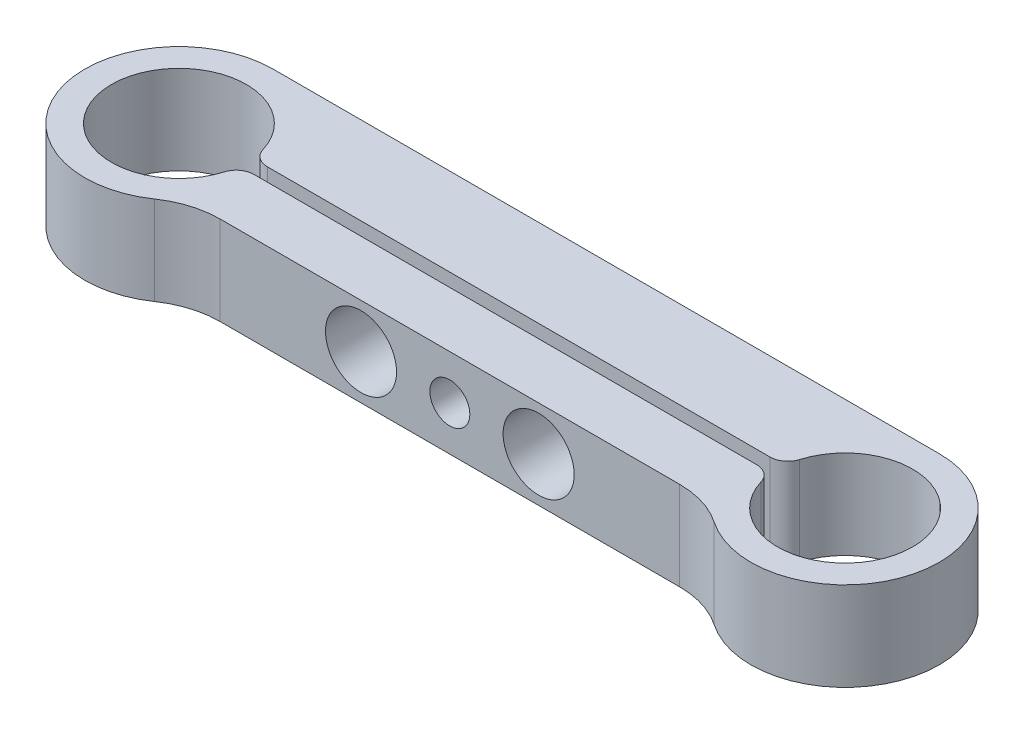
ISO-10303-21;
HEADER;
FILE_DESCRIPTION(('STEP AP214'),'2;1');
FILE_NAME('part.step','',(''),(''),'','','');
FILE_SCHEMA(('AUTOMOTIVE_DESIGN { 1 0 10303 214 1 1 1 1 }'));
ENDSEC;
DATA;
#1=APPLICATION_CONTEXT('core data for automotive mechanical design processes');
#2=APPLICATION_PROTOCOL_DEFINITION('international standard','automotive_design',2000,#1);
#3=PRODUCT_CONTEXT('',#1,'mechanical');
#4=PRODUCT('Part','Part','',(#3));
#5=PRODUCT_RELATED_PRODUCT_CATEGORY('part','',(#4));
#6=PRODUCT_DEFINITION_FORMATION('','',#4);
#7=PRODUCT_DEFINITION_CONTEXT('part definition',#1,'design');
#8=PRODUCT_DEFINITION('design','',#6,#7);
#9=PRODUCT_DEFINITION_SHAPE('','',#8);
#10=(LENGTH_UNIT() NAMED_UNIT(*) SI_UNIT(.MILLI.,.METRE.));
#11=(NAMED_UNIT(*) PLANE_ANGLE_UNIT() SI_UNIT($,.RADIAN.));
#12=(NAMED_UNIT(*) SI_UNIT($,.STERADIAN.) SOLID_ANGLE_UNIT());
#13=UNCERTAINTY_MEASURE_WITH_UNIT(LENGTH_MEASURE(1.E-05),#10,'distance_accuracy_value','');
#14=(GEOMETRIC_REPRESENTATION_CONTEXT(3) GLOBAL_UNCERTAINTY_ASSIGNED_CONTEXT((#13)) GLOBAL_UNIT_ASSIGNED_CONTEXT((#10,
#11,#12)) REPRESENTATION_CONTEXT('',''));
#15=CARTESIAN_POINT('',(0.,0.,0.));
#16=DIRECTION('',(0.,0.,1.));
#17=DIRECTION('',(1.,0.,0.));
#18=AXIS2_PLACEMENT_3D('',#15,#16,#17);
#19=CARTESIAN_POINT('',(75.,10.,-1.34818998548608E-11));
#20=DIRECTION('',(0.,1.,0.));
#21=DIRECTION('',(0.,0.,1.));
#22=AXIS2_PLACEMENT_3D('',#19,#20,#21);
#23=PLANE('',#22);
#24=DIRECTION('',(1.,0.,0.));
#25=VECTOR('',#24,1.);
#26=CARTESIAN_POINT('',(67.0401005031589,10.,7.));
#27=LINE('',#26,#25);
#28=CARTESIAN_POINT('',(11.634431657835,10.,7.00000000000001));
#29=VERTEX_POINT('',#28);
#30=CARTESIAN_POINT('',(63.3655683421966,10.,7.));
#31=VERTEX_POINT('',#30);
#32=EDGE_CURVE('E180',#29,#31,#27,.T.);
#33=ORIENTED_EDGE('',*,*,#32,.T.);
#34=CARTESIAN_POINT('',(63.3655683421966,10.,17.));
#35=DIRECTION('',(0.,1.,0.));
#36=DIRECTION('',(0.,0.,1.));
#37=AXIS2_PLACEMENT_3D('',#34,#35,#36);
#38=CIRCLE('',#37,10.);
#39=CARTESIAN_POINT('',(69.0133507003499,10.,8.74757281553284));
#40=VERTEX_POINT('',#39);
#41=EDGE_CURVE('E156',#31,#40,#38,.F.);
#42=ORIENTED_EDGE('',*,*,#41,.T.);
#43=CARTESIAN_POINT('',(75.,10.,-1.34818998548608E-11));
#44=DIRECTION('',(0.,1.,0.));
#45=DIRECTION('',(0.,0.,1.));
#46=AXIS2_PLACEMENT_3D('',#43,#44,#45);
#47=CIRCLE('',#46,10.6000000000135);
#48=CARTESIAN_POINT('',(75.,10.,-10.6000000000404));
#49=VERTEX_POINT('',#48);
#50=EDGE_CURVE('E149',#40,#49,#47,.T.);
#51=ORIENTED_EDGE('',*,*,#50,.T.);
#52=DIRECTION('',(-1.,0.,0.));
#53=VECTOR('',#52,1.);
#54=CARTESIAN_POINT('',(0.,10.,-10.6000000000404));
#55=LINE('',#54,#53);
#56=CARTESIAN_POINT('',(0.,10.,-10.6000000000202));
#57=VERTEX_POINT('',#56);
#58=EDGE_CURVE('E153',#49,#57,#55,.T.);
#59=ORIENTED_EDGE('',*,*,#58,.T.);
#60=CARTESIAN_POINT('',(0.,10.,0.));
#61=DIRECTION('',(0.,1.,0.));
#62=DIRECTION('',(0.,0.,1.));
#63=AXIS2_PLACEMENT_3D('',#60,#61,#62);
#64=CIRCLE('',#63,10.6000000000202);
#65=CARTESIAN_POINT('',(5.9866492996682,10.,8.74757281554209));
#66=VERTEX_POINT('',#65);
#67=EDGE_CURVE('E170',#57,#66,#64,.T.);
#68=ORIENTED_EDGE('',*,*,#67,.T.);
#69=CARTESIAN_POINT('',(11.634431657835,10.,17.));
#70=DIRECTION('',(0.,1.,0.));
#71=DIRECTION('',(0.,0.,1.));
#72=AXIS2_PLACEMENT_3D('',#69,#70,#71);
#73=CIRCLE('',#72,10.);
#74=EDGE_CURVE('E192',#66,#29,#73,.F.);
#75=ORIENTED_EDGE('',*,*,#74,.T.);
#76=EDGE_LOOP('',(#33,#42,#51,#59,#68,#75));
#77=FACE_BOUND('',#76,.T.);
#78=DIRECTION('',(-1.,0.,0.));
#79=VECTOR('',#78,1.);
#80=CARTESIAN_POINT('',(7.5629028818305,10.,-0.75));
#81=LINE('',#80,#79);
#82=CARTESIAN_POINT('',(65.8023100726297,10.,-0.75));
#83=VERTEX_POINT('',#82);
#84=CARTESIAN_POINT('',(9.19768992736763,10.,-0.75));
#85=VERTEX_POINT('',#84);
#86=EDGE_CURVE('E258',#83,#85,#81,.T.);
#87=ORIENTED_EDGE('',*,*,#86,.F.);
#88=CARTESIAN_POINT('',(65.8023100726297,10.,-2.75));
#89=DIRECTION('',(0.,1.,0.));
#90=DIRECTION('',(0.,0.,1.));
#91=AXIS2_PLACEMENT_3D('',#88,#89,#90);
#92=CIRCLE('',#91,2.);
#93=CARTESIAN_POINT('',(67.7184954741655,10.,-2.17708333333606));
#94=VERTEX_POINT('',#93);
#95=EDGE_CURVE('E220',#83,#94,#92,.T.);
#96=ORIENTED_EDGE('',*,*,#95,.T.);
#97=CARTESIAN_POINT('',(75.,10.,-1.34818998548608E-11));
#98=DIRECTION('',(0.,1.,0.));
#99=DIRECTION('',(0.,0.,1.));
#100=AXIS2_PLACEMENT_3D('',#97,#98,#99);
#101=CIRCLE('',#100,7.59999999999867);
#102=CARTESIAN_POINT('',(67.7184954741718,10.,2.17708333333045));
#103=VERTEX_POINT('',#102);
#104=EDGE_CURVE('E458',#103,#94,#101,.T.);
#105=ORIENTED_EDGE('',*,*,#104,.F.);
#106=CARTESIAN_POINT('',(65.8023100726378,10.,2.75));
#107=DIRECTION('',(0.,1.,0.));
#108=DIRECTION('',(0.,0.,1.));
#109=AXIS2_PLACEMENT_3D('',#106,#107,#108);
#110=CIRCLE('',#109,2.);
#111=CARTESIAN_POINT('',(65.8023100726378,10.,0.75));
#112=VERTEX_POINT('',#111);
#113=EDGE_CURVE('E218',#103,#112,#110,.T.);
#114=ORIENTED_EDGE('',*,*,#113,.T.);
#115=DIRECTION('',(1.,0.,0.));
#116=VECTOR('',#115,1.);
#117=CARTESIAN_POINT('',(7.5629028818305,10.,0.75));
#118=LINE('',#117,#116);
#119=CARTESIAN_POINT('',(9.19768992736763,10.,0.75));
#120=VERTEX_POINT('',#119);
#121=EDGE_CURVE('E234',#120,#112,#118,.T.);
#122=ORIENTED_EDGE('',*,*,#121,.F.);
#123=CARTESIAN_POINT('',(9.19768992736763,10.,2.75));
#124=DIRECTION('',(0.,1.,0.));
#125=DIRECTION('',(0.,0.,1.));
#126=AXIS2_PLACEMENT_3D('',#123,#124,#125);
#127=CIRCLE('',#126,2.);
#128=CARTESIAN_POINT('',(7.28150452583271,10.,2.17708333333333));
#129=VERTEX_POINT('',#128);
#130=EDGE_CURVE('E63',#120,#129,#127,.T.);
#131=ORIENTED_EDGE('',*,*,#130,.T.);
#132=CARTESIAN_POINT('',(0.,10.,0.));
#133=DIRECTION('',(0.,1.,0.));
#134=DIRECTION('',(0.,0.,1.));
#135=AXIS2_PLACEMENT_3D('',#132,#133,#134);
#136=CIRCLE('',#135,7.6);
#137=CARTESIAN_POINT('',(7.28150452583271,10.,-2.17708333333333));
#138=VERTEX_POINT('',#137);
#139=EDGE_CURVE('E252',#138,#129,#136,.T.);
#140=ORIENTED_EDGE('',*,*,#139,.F.);
#141=CARTESIAN_POINT('',(9.19768992736763,10.,-2.75));
#142=DIRECTION('',(0.,1.,0.));
#143=DIRECTION('',(0.,0.,1.));
#144=AXIS2_PLACEMENT_3D('',#141,#142,#143);
#145=CIRCLE('',#144,2.);
#146=EDGE_CURVE('E215',#138,#85,#145,.T.);
#147=ORIENTED_EDGE('',*,*,#146,.T.);
#148=EDGE_LOOP('',(#87,#96,#105,#114,#122,#131,#140,#147));
#149=FACE_BOUND('',#148,.T.);
#150=ADVANCED_FACE('F48',(#77,#149),#23,.T.);
#151=CARTESIAN_POINT('',(75.,0.,-1.34818998548608E-11));
#152=DIRECTION('',(0.,1.,0.));
#153=DIRECTION('',(0.,0.,1.));
#154=AXIS2_PLACEMENT_3D('',#151,#152,#153);
#155=PLANE('',#154);
#156=CARTESIAN_POINT('',(75.,0.,-1.34818998548608E-11));
#157=DIRECTION('',(0.,1.,0.));
#158=DIRECTION('',(0.,0.,1.));
#159=AXIS2_PLACEMENT_3D('',#156,#157,#158);
#160=CIRCLE('',#159,10.6000000000135);
#161=CARTESIAN_POINT('',(69.0133507003499,0.,8.74757281553284));
#162=VERTEX_POINT('',#161);
#163=CARTESIAN_POINT('',(75.,0.,-10.6000000000404));
#164=VERTEX_POINT('',#163);
#165=EDGE_CURVE('E174',#162,#164,#160,.T.);
#166=ORIENTED_EDGE('',*,*,#165,.F.);
#167=CARTESIAN_POINT('',(63.3655683421966,0.,17.));
#168=DIRECTION('',(0.,1.,0.));
#169=DIRECTION('',(0.,0.,1.));
#170=AXIS2_PLACEMENT_3D('',#167,#168,#169);
#171=CIRCLE('',#170,10.);
#172=CARTESIAN_POINT('',(63.3655683421966,0.,7.));
#173=VERTEX_POINT('',#172);
#174=EDGE_CURVE('E194',#162,#173,#171,.T.);
#175=ORIENTED_EDGE('',*,*,#174,.T.);
#176=DIRECTION('',(1.,0.,0.));
#177=VECTOR('',#176,1.);
#178=CARTESIAN_POINT('',(67.0401005031589,0.,7.));
#179=LINE('',#178,#177);
#180=CARTESIAN_POINT('',(11.634431657835,0.,7.00000000000001));
#181=VERTEX_POINT('',#180);
#182=EDGE_CURVE('E161',#181,#173,#179,.T.);
#183=ORIENTED_EDGE('',*,*,#182,.F.);
#184=CARTESIAN_POINT('',(11.634431657835,0.,17.));
#185=DIRECTION('',(0.,1.,0.));
#186=DIRECTION('',(0.,0.,1.));
#187=AXIS2_PLACEMENT_3D('',#184,#185,#186);
#188=CIRCLE('',#187,10.);
#189=CARTESIAN_POINT('',(5.9866492996682,0.,8.74757281554209));
#190=VERTEX_POINT('',#189);
#191=EDGE_CURVE('E190',#181,#190,#188,.T.);
#192=ORIENTED_EDGE('',*,*,#191,.T.);
#193=CARTESIAN_POINT('',(0.,0.,0.));
#194=DIRECTION('',(0.,1.,0.));
#195=DIRECTION('',(0.,0.,1.));
#196=AXIS2_PLACEMENT_3D('',#193,#194,#195);
#197=CIRCLE('',#196,10.6000000000202);
#198=CARTESIAN_POINT('',(0.,0.,-10.6000000000202));
#199=VERTEX_POINT('',#198);
#200=EDGE_CURVE('E260',#199,#190,#197,.T.);
#201=ORIENTED_EDGE('',*,*,#200,.F.);
#202=DIRECTION('',(-1.,0.,0.));
#203=VECTOR('',#202,1.);
#204=CARTESIAN_POINT('',(0.,0.,-10.6000000000404));
#205=LINE('',#204,#203);
#206=EDGE_CURVE('E257',#164,#199,#205,.T.);
#207=ORIENTED_EDGE('',*,*,#206,.F.);
#208=EDGE_LOOP('',(#166,#175,#183,#192,#201,#207));
#209=FACE_BOUND('',#208,.T.);
#210=CARTESIAN_POINT('',(75.,0.,-1.34818998548608E-11));
#211=DIRECTION('',(0.,1.,0.));
#212=DIRECTION('',(0.,0.,1.));
#213=AXIS2_PLACEMENT_3D('',#210,#211,#212);
#214=CIRCLE('',#213,7.59999999999867);
#215=CARTESIAN_POINT('',(67.7184954741718,0.,2.17708333333045));
#216=VERTEX_POINT('',#215);
#217=CARTESIAN_POINT('',(67.7184954741655,0.,-2.17708333333606));
#218=VERTEX_POINT('',#217);
#219=EDGE_CURVE('E242',#216,#218,#214,.T.);
#220=ORIENTED_EDGE('',*,*,#219,.T.);
#221=CARTESIAN_POINT('',(65.8023100726297,0.,-2.75));
#222=DIRECTION('',(0.,1.,0.));
#223=DIRECTION('',(0.,0.,1.));
#224=AXIS2_PLACEMENT_3D('',#221,#222,#223);
#225=CIRCLE('',#224,2.);
#226=CARTESIAN_POINT('',(65.8023100726297,0.,-0.75));
#227=VERTEX_POINT('',#226);
#228=EDGE_CURVE('E208',#218,#227,#225,.F.);
#229=ORIENTED_EDGE('',*,*,#228,.T.);
#230=DIRECTION('',(-1.,0.,0.));
#231=VECTOR('',#230,1.);
#232=CARTESIAN_POINT('',(7.5629028818305,0.,-0.75));
#233=LINE('',#232,#231);
#234=CARTESIAN_POINT('',(9.19768992736763,0.,-0.75));
#235=VERTEX_POINT('',#234);
#236=EDGE_CURVE('E245',#227,#235,#233,.T.);
#237=ORIENTED_EDGE('',*,*,#236,.T.);
#238=CARTESIAN_POINT('',(9.19768992736763,0.,-2.75));
#239=DIRECTION('',(0.,1.,0.));
#240=DIRECTION('',(0.,0.,1.));
#241=AXIS2_PLACEMENT_3D('',#238,#239,#240);
#242=CIRCLE('',#241,2.);
#243=CARTESIAN_POINT('',(7.28150452583271,0.,-2.17708333333333));
#244=VERTEX_POINT('',#243);
#245=EDGE_CURVE('E202',#235,#244,#242,.F.);
#246=ORIENTED_EDGE('',*,*,#245,.T.);
#247=CARTESIAN_POINT('',(0.,0.,0.));
#248=DIRECTION('',(0.,1.,0.));
#249=DIRECTION('',(0.,0.,1.));
#250=AXIS2_PLACEMENT_3D('',#247,#248,#249);
#251=CIRCLE('',#250,7.6);
#252=CARTESIAN_POINT('',(7.28150452583271,0.,2.17708333333333));
#253=VERTEX_POINT('',#252);
#254=EDGE_CURVE('E243',#244,#253,#251,.T.);
#255=ORIENTED_EDGE('',*,*,#254,.T.);
#256=CARTESIAN_POINT('',(9.19768992736763,0.,2.75));
#257=DIRECTION('',(0.,1.,0.));
#258=DIRECTION('',(0.,0.,1.));
#259=AXIS2_PLACEMENT_3D('',#256,#257,#258);
#260=CIRCLE('',#259,2.);
#261=CARTESIAN_POINT('',(9.19768992736763,0.,0.75));
#262=VERTEX_POINT('',#261);
#263=EDGE_CURVE('E204',#253,#262,#260,.F.);
#264=ORIENTED_EDGE('',*,*,#263,.T.);
#265=DIRECTION('',(1.,0.,0.));
#266=VECTOR('',#265,1.);
#267=CARTESIAN_POINT('',(7.5629028818305,0.,0.75));
#268=LINE('',#267,#266);
#269=CARTESIAN_POINT('',(65.8023100726378,0.,0.75));
#270=VERTEX_POINT('',#269);
#271=EDGE_CURVE('E232',#262,#270,#268,.T.);
#272=ORIENTED_EDGE('',*,*,#271,.T.);
#273=CARTESIAN_POINT('',(65.8023100726378,0.,2.75));
#274=DIRECTION('',(0.,1.,0.));
#275=DIRECTION('',(0.,0.,1.));
#276=AXIS2_PLACEMENT_3D('',#273,#274,#275);
#277=CIRCLE('',#276,2.);
#278=EDGE_CURVE('E206',#270,#216,#277,.F.);
#279=ORIENTED_EDGE('',*,*,#278,.T.);
#280=EDGE_LOOP('',(#220,#229,#237,#246,#255,#264,#272,#279));
#281=FACE_BOUND('',#280,.T.);
#282=ADVANCED_FACE('F239',(#209,#281),#155,.F.);
#283=CARTESIAN_POINT('',(75.,10.,-1.34818998548608E-11));
#284=DIRECTION('',(0.,-1.,0.));
#285=DIRECTION('',(0.,0.,-1.));
#286=AXIS2_PLACEMENT_3D('',#283,#284,#285);
#287=CYLINDRICAL_SURFACE('',#286,10.6000000000135);
#288=ORIENTED_EDGE('',*,*,#50,.F.);
#289=DIRECTION('',(0.,-1.,0.));
#290=VECTOR('',#289,1.);
#291=CARTESIAN_POINT('',(69.0133507003499,10.,8.74757281553284));
#292=LINE('',#291,#290);
#293=EDGE_CURVE('E188',#40,#162,#292,.T.);
#294=ORIENTED_EDGE('',*,*,#293,.T.);
#295=ORIENTED_EDGE('',*,*,#165,.T.);
#296=DIRECTION('',(0.,-1.,0.));
#297=VECTOR('',#296,1.);
#298=CARTESIAN_POINT('',(75.,10.,-10.6000000000404));
#299=LINE('',#298,#297);
#300=EDGE_CURVE('E166',#49,#164,#299,.T.);
#301=ORIENTED_EDGE('',*,*,#300,.F.);
#302=EDGE_LOOP('',(#288,#294,#295,#301));
#303=FACE_BOUND('',#302,.T.);
#304=ADVANCED_FACE('F172',(#303),#287,.T.);
#305=CARTESIAN_POINT('',(0.,10.,-10.6000000000404));
#306=DIRECTION('',(0.,0.,1.));
#307=DIRECTION('',(1.,0.,0.));
#308=AXIS2_PLACEMENT_3D('',#305,#306,#307);
#309=PLANE('',#308);
#310=CARTESIAN_POINT('',(37.5000000000059,5.,-10.6000000000404));
#311=DIRECTION('',(0.,0.,1.));
#312=DIRECTION('',(1.,0.,0.));
#313=AXIS2_PLACEMENT_3D('',#310,#311,#312);
#314=CIRCLE('',#313,1.65);
#315=CARTESIAN_POINT('',(39.1500000000059,5.,-10.6000000000404));
#316=VERTEX_POINT('',#315);
#317=EDGE_CURVE('E493',#316,#316,#314,.T.);
#318=ORIENTED_EDGE('',*,*,#317,.T.);
#319=EDGE_LOOP('',(#318));
#320=FACE_BOUND('',#319,.T.);
#321=CARTESIAN_POINT('',(47.5000000000059,5.,-10.6000000000404));
#322=DIRECTION('',(0.,0.,1.));
#323=DIRECTION('',(1.,0.,0.));
#324=AXIS2_PLACEMENT_3D('',#321,#322,#323);
#325=CIRCLE('',#324,2.24999999999999);
#326=CARTESIAN_POINT('',(49.7500000000059,5.,-10.6000000000404));
#327=VERTEX_POINT('',#326);
#328=EDGE_CURVE('E481',#327,#327,#325,.T.);
#329=ORIENTED_EDGE('',*,*,#328,.T.);
#330=EDGE_LOOP('',(#329));
#331=FACE_BOUND('',#330,.T.);
#332=CARTESIAN_POINT('',(27.5000000000059,5.,-10.6000000000404));
#333=DIRECTION('',(0.,0.,1.));
#334=DIRECTION('',(1.,0.,0.));
#335=AXIS2_PLACEMENT_3D('',#332,#333,#334);
#336=CIRCLE('',#335,2.24999999999999);
#337=CARTESIAN_POINT('',(29.7500000000059,5.,-10.6000000000404));
#338=VERTEX_POINT('',#337);
#339=EDGE_CURVE('E475',#338,#338,#336,.T.);
#340=ORIENTED_EDGE('',*,*,#339,.T.);
#341=EDGE_LOOP('',(#340));
#342=FACE_BOUND('',#341,.T.);
#343=ORIENTED_EDGE('',*,*,#206,.T.);
#344=DIRECTION('',(0.,-1.,0.));
#345=VECTOR('',#344,1.);
#346=CARTESIAN_POINT('',(0.,10.,-10.6000000000202));
#347=LINE('',#346,#345);
#348=EDGE_CURVE('E168',#57,#199,#347,.T.);
#349=ORIENTED_EDGE('',*,*,#348,.F.);
#350=ORIENTED_EDGE('',*,*,#58,.F.);
#351=ORIENTED_EDGE('',*,*,#300,.T.);
#352=EDGE_LOOP('',(#343,#349,#350,#351));
#353=FACE_BOUND('',#352,.T.);
#354=ADVANCED_FACE('F165',(#320,#331,#342,#353),#309,.F.);
#355=CARTESIAN_POINT('',(0.,10.,0.));
#356=DIRECTION('',(0.,-1.,0.));
#357=DIRECTION('',(0.,0.,-1.));
#358=AXIS2_PLACEMENT_3D('',#355,#356,#357);
#359=CYLINDRICAL_SURFACE('',#358,10.6000000000202);
#360=ORIENTED_EDGE('',*,*,#200,.T.);
#361=DIRECTION('',(0.,-1.,0.));
#362=VECTOR('',#361,1.);
#363=CARTESIAN_POINT('',(5.98664929966821,10.,8.74757281554209));
#364=LINE('',#363,#362);
#365=EDGE_CURVE('E186',#190,#66,#364,.F.);
#366=ORIENTED_EDGE('',*,*,#365,.T.);
#367=ORIENTED_EDGE('',*,*,#67,.F.);
#368=ORIENTED_EDGE('',*,*,#348,.T.);
#369=EDGE_LOOP('',(#360,#366,#367,#368));
#370=FACE_BOUND('',#369,.T.);
#371=ADVANCED_FACE('F274',(#370),#359,.T.);
#372=CARTESIAN_POINT('',(67.0401005031589,10.,7.));
#373=DIRECTION('',(0.,0.,-1.));
#374=DIRECTION('',(-1.,0.,0.));
#375=AXIS2_PLACEMENT_3D('',#372,#373,#374);
#376=PLANE('',#375);
#377=CARTESIAN_POINT('',(37.5000000000059,5.,7.00000000000001));
#378=DIRECTION('',(0.,0.,1.));
#379=DIRECTION('',(1.,0.,0.));
#380=AXIS2_PLACEMENT_3D('',#377,#378,#379);
#381=CIRCLE('',#380,2.24999999999999);
#382=CARTESIAN_POINT('',(39.7500000000059,5.,7.00000000000001));
#383=VERTEX_POINT('',#382);
#384=EDGE_CURVE('E490',#383,#383,#381,.T.);
#385=ORIENTED_EDGE('',*,*,#384,.F.);
#386=EDGE_LOOP('',(#385));
#387=FACE_BOUND('',#386,.T.);
#388=CARTESIAN_POINT('',(27.5000000000059,5.,7.00000000000001));
#389=DIRECTION('',(0.,0.,1.));
#390=DIRECTION('',(1.,0.,0.));
#391=AXIS2_PLACEMENT_3D('',#388,#389,#390);
#392=CIRCLE('',#391,3.99999999999999);
#393=CARTESIAN_POINT('',(31.5000000000059,5.,7.00000000000001));
#394=VERTEX_POINT('',#393);
#395=EDGE_CURVE('E472',#394,#394,#392,.T.);
#396=ORIENTED_EDGE('',*,*,#395,.F.);
#397=EDGE_LOOP('',(#396));
#398=FACE_BOUND('',#397,.T.);
#399=CARTESIAN_POINT('',(47.5000000000059,5.,7.00000000000001));
#400=DIRECTION('',(0.,0.,1.));
#401=DIRECTION('',(1.,0.,0.));
#402=AXIS2_PLACEMENT_3D('',#399,#400,#401);
#403=CIRCLE('',#402,3.99999999999999);
#404=CARTESIAN_POINT('',(51.5000000000059,5.,7.00000000000001));
#405=VERTEX_POINT('',#404);
#406=EDGE_CURVE('E466',#405,#405,#403,.T.);
#407=ORIENTED_EDGE('',*,*,#406,.F.);
#408=EDGE_LOOP('',(#407));
#409=FACE_BOUND('',#408,.T.);
#410=ORIENTED_EDGE('',*,*,#32,.F.);
#411=DIRECTION('',(0.,1.,0.));
#412=VECTOR('',#411,1.);
#413=CARTESIAN_POINT('',(11.634431657835,0.,7.00000000000001));
#414=LINE('',#413,#412);
#415=EDGE_CURVE('E178',#29,#181,#414,.F.);
#416=ORIENTED_EDGE('',*,*,#415,.T.);
#417=ORIENTED_EDGE('',*,*,#182,.T.);
#418=DIRECTION('',(0.,1.,0.));
#419=VECTOR('',#418,1.);
#420=CARTESIAN_POINT('',(63.3655683421966,10.,7.));
#421=LINE('',#420,#419);
#422=EDGE_CURVE('E176',#173,#31,#421,.T.);
#423=ORIENTED_EDGE('',*,*,#422,.T.);
#424=EDGE_LOOP('',(#410,#416,#417,#423));
#425=FACE_BOUND('',#424,.T.);
#426=ADVANCED_FACE('F267',(#387,#398,#409,#425),#376,.F.);
#427=CARTESIAN_POINT('',(0.,10.,0.));
#428=DIRECTION('',(0.,-1.,0.));
#429=DIRECTION('',(0.,0.,-1.));
#430=AXIS2_PLACEMENT_3D('',#427,#428,#429);
#431=CYLINDRICAL_SURFACE('',#430,7.6);
#432=ORIENTED_EDGE('',*,*,#139,.T.);
#433=DIRECTION('',(0.,-1.,0.));
#434=VECTOR('',#433,1.);
#435=CARTESIAN_POINT('',(7.28150452583271,10.,2.17708333333333));
#436=LINE('',#435,#434);
#437=EDGE_CURVE('E13',#129,#253,#436,.T.);
#438=ORIENTED_EDGE('',*,*,#437,.T.);
#439=ORIENTED_EDGE('',*,*,#254,.F.);
#440=DIRECTION('',(0.,-1.,0.));
#441=VECTOR('',#440,1.);
#442=CARTESIAN_POINT('',(7.28150452583271,10.,-2.17708333333333));
#443=LINE('',#442,#441);
#444=EDGE_CURVE('E56',#244,#138,#443,.F.);
#445=ORIENTED_EDGE('',*,*,#444,.T.);
#446=EDGE_LOOP('',(#432,#438,#439,#445));
#447=FACE_BOUND('',#446,.T.);
#448=ADVANCED_FACE('F299',(#447),#431,.F.);
#449=CARTESIAN_POINT('',(7.5629028818305,10.,0.75));
#450=DIRECTION('',(0.,0.,-1.));
#451=DIRECTION('',(-1.,0.,0.));
#452=AXIS2_PLACEMENT_3D('',#449,#450,#451);
#453=PLANE('',#452);
#454=CARTESIAN_POINT('',(37.5000000000059,5.,0.75));
#455=DIRECTION('',(0.,0.,-1.));
#456=DIRECTION('',(-1.,0.,0.));
#457=AXIS2_PLACEMENT_3D('',#454,#455,#456);
#458=CIRCLE('',#457,2.25);
#459=CARTESIAN_POINT('',(35.2500000000059,5.,0.75));
#460=VERTEX_POINT('',#459);
#461=EDGE_CURVE('E487',#460,#460,#458,.T.);
#462=ORIENTED_EDGE('',*,*,#461,.F.);
#463=EDGE_LOOP('',(#462));
#464=FACE_BOUND('',#463,.T.);
#465=CARTESIAN_POINT('',(27.5000000000059,5.,0.75));
#466=DIRECTION('',(0.,0.,-1.));
#467=DIRECTION('',(-1.,0.,0.));
#468=AXIS2_PLACEMENT_3D('',#465,#466,#467);
#469=CIRCLE('',#468,3.99999999999999);
#470=CARTESIAN_POINT('',(23.5000000000059,5.,0.75));
#471=VERTEX_POINT('',#470);
#472=EDGE_CURVE('E469',#471,#471,#469,.T.);
#473=ORIENTED_EDGE('',*,*,#472,.F.);
#474=EDGE_LOOP('',(#473));
#475=FACE_BOUND('',#474,.T.);
#476=CARTESIAN_POINT('',(47.5000000000059,5.,0.75));
#477=DIRECTION('',(0.,0.,-1.));
#478=DIRECTION('',(-1.,0.,0.));
#479=AXIS2_PLACEMENT_3D('',#476,#477,#478);
#480=CIRCLE('',#479,3.99999999999999);
#481=CARTESIAN_POINT('',(43.5000000000059,5.,0.75));
#482=VERTEX_POINT('',#481);
#483=EDGE_CURVE('E247',#482,#482,#480,.T.);
#484=ORIENTED_EDGE('',*,*,#483,.F.);
#485=EDGE_LOOP('',(#484));
#486=FACE_BOUND('',#485,.T.);
#487=ORIENTED_EDGE('',*,*,#121,.T.);
#488=DIRECTION('',(0.,-1.,0.));
#489=VECTOR('',#488,1.);
#490=CARTESIAN_POINT('',(65.8023100726378,10.,0.75));
#491=LINE('',#490,#489);
#492=EDGE_CURVE('E224',#112,#270,#491,.T.);
#493=ORIENTED_EDGE('',*,*,#492,.T.);
#494=ORIENTED_EDGE('',*,*,#271,.F.);
#495=DIRECTION('',(0.,-1.,0.));
#496=VECTOR('',#495,1.);
#497=CARTESIAN_POINT('',(9.19768992736763,10.,0.75));
#498=LINE('',#497,#496);
#499=EDGE_CURVE('E222',#262,#120,#498,.F.);
#500=ORIENTED_EDGE('',*,*,#499,.T.);
#501=EDGE_LOOP('',(#487,#493,#494,#500));
#502=FACE_BOUND('',#501,.T.);
#503=ADVANCED_FACE('F231',(#464,#475,#486,#502),#453,.T.);
#504=CARTESIAN_POINT('',(75.,10.,-1.34818998548608E-11));
#505=DIRECTION('',(0.,-1.,0.));
#506=DIRECTION('',(0.,0.,-1.));
#507=AXIS2_PLACEMENT_3D('',#504,#505,#506);
#508=CYLINDRICAL_SURFACE('',#507,7.59999999999867);
#509=ORIENTED_EDGE('',*,*,#104,.T.);
#510=DIRECTION('',(0.,-1.,0.));
#511=VECTOR('',#510,1.);
#512=CARTESIAN_POINT('',(67.7184954741655,10.,-2.17708333333606));
#513=LINE('',#512,#511);
#514=EDGE_CURVE('E199',#94,#218,#513,.T.);
#515=ORIENTED_EDGE('',*,*,#514,.T.);
#516=ORIENTED_EDGE('',*,*,#219,.F.);
#517=DIRECTION('',(0.,-1.,0.));
#518=VECTOR('',#517,1.);
#519=CARTESIAN_POINT('',(67.7184954741718,10.,2.17708333333045));
#520=LINE('',#519,#518);
#521=EDGE_CURVE('E197',#216,#103,#520,.F.);
#522=ORIENTED_EDGE('',*,*,#521,.T.);
#523=EDGE_LOOP('',(#509,#515,#516,#522));
#524=FACE_BOUND('',#523,.T.);
#525=ADVANCED_FACE('F339',(#524),#508,.F.);
#526=CARTESIAN_POINT('',(7.5629028818305,10.,-0.75));
#527=DIRECTION('',(0.,0.,1.));
#528=DIRECTION('',(1.,0.,0.));
#529=AXIS2_PLACEMENT_3D('',#526,#527,#528);
#530=PLANE('',#529);
#531=CARTESIAN_POINT('',(37.5000000000059,5.,-0.749999999999999));
#532=DIRECTION('',(0.,0.,1.));
#533=DIRECTION('',(1.,0.,0.));
#534=AXIS2_PLACEMENT_3D('',#531,#532,#533);
#535=CIRCLE('',#534,1.64999999999999);
#536=CARTESIAN_POINT('',(39.1500000000059,5.,-0.749999999999999));
#537=VERTEX_POINT('',#536);
#538=EDGE_CURVE('E496',#537,#537,#535,.T.);
#539=ORIENTED_EDGE('',*,*,#538,.F.);
#540=EDGE_LOOP('',(#539));
#541=FACE_BOUND('',#540,.T.);
#542=CARTESIAN_POINT('',(47.5000000000059,5.,-0.749999999999999));
#543=DIRECTION('',(0.,0.,1.));
#544=DIRECTION('',(1.,0.,0.));
#545=AXIS2_PLACEMENT_3D('',#542,#543,#544);
#546=CIRCLE('',#545,2.24999999999999);
#547=CARTESIAN_POINT('',(49.7500000000059,5.,-0.749999999999999));
#548=VERTEX_POINT('',#547);
#549=EDGE_CURVE('E484',#548,#548,#546,.T.);
#550=ORIENTED_EDGE('',*,*,#549,.F.);
#551=EDGE_LOOP('',(#550));
#552=FACE_BOUND('',#551,.T.);
#553=CARTESIAN_POINT('',(27.5000000000059,5.,-0.749999999999999));
#554=DIRECTION('',(0.,0.,1.));
#555=DIRECTION('',(1.,0.,0.));
#556=AXIS2_PLACEMENT_3D('',#553,#554,#555);
#557=CIRCLE('',#556,2.24999999999999);
#558=CARTESIAN_POINT('',(29.7500000000059,5.,-0.749999999999999));
#559=VERTEX_POINT('',#558);
#560=EDGE_CURVE('E478',#559,#559,#557,.T.);
#561=ORIENTED_EDGE('',*,*,#560,.F.);
#562=EDGE_LOOP('',(#561));
#563=FACE_BOUND('',#562,.T.);
#564=ORIENTED_EDGE('',*,*,#236,.F.);
#565=DIRECTION('',(0.,-1.,0.));
#566=VECTOR('',#565,1.);
#567=CARTESIAN_POINT('',(65.8023100726297,10.,-0.75));
#568=LINE('',#567,#566);
#569=EDGE_CURVE('E213',#227,#83,#568,.F.);
#570=ORIENTED_EDGE('',*,*,#569,.T.);
#571=ORIENTED_EDGE('',*,*,#86,.T.);
#572=DIRECTION('',(0.,-1.,0.));
#573=VECTOR('',#572,1.);
#574=CARTESIAN_POINT('',(9.19768992736763,10.,-0.75));
#575=LINE('',#574,#573);
#576=EDGE_CURVE('E210',#85,#235,#575,.T.);
#577=ORIENTED_EDGE('',*,*,#576,.T.);
#578=EDGE_LOOP('',(#564,#570,#571,#577));
#579=FACE_BOUND('',#578,.T.);
#580=ADVANCED_FACE('F346',(#541,#552,#563,#579),#530,.T.);
#581=CARTESIAN_POINT('',(47.5000000000059,5.,7.00000000000001));
#582=DIRECTION('',(0.,0.,1.));
#583=DIRECTION('',(1.,0.,0.));
#584=AXIS2_PLACEMENT_3D('',#581,#582,#583);
#585=CYLINDRICAL_SURFACE('',#584,3.99999999999999);
#586=ORIENTED_EDGE('',*,*,#406,.T.);
#587=EDGE_LOOP('',(#586));
#588=FACE_BOUND('',#587,.T.);
#589=ORIENTED_EDGE('',*,*,#483,.T.);
#590=EDGE_LOOP('',(#589));
#591=FACE_BOUND('',#590,.T.);
#592=ADVANCED_FACE('F354',(#588,#591),#585,.F.);
#593=CARTESIAN_POINT('',(27.5000000000059,5.,7.00000000000001));
#594=DIRECTION('',(0.,0.,1.));
#595=DIRECTION('',(1.,0.,0.));
#596=AXIS2_PLACEMENT_3D('',#593,#594,#595);
#597=CYLINDRICAL_SURFACE('',#596,3.99999999999999);
#598=ORIENTED_EDGE('',*,*,#395,.T.);
#599=EDGE_LOOP('',(#598));
#600=FACE_BOUND('',#599,.T.);
#601=ORIENTED_EDGE('',*,*,#472,.T.);
#602=EDGE_LOOP('',(#601));
#603=FACE_BOUND('',#602,.T.);
#604=ADVANCED_FACE('F363',(#600,#603),#597,.F.);
#605=CARTESIAN_POINT('',(27.5000000000059,5.,-0.75));
#606=DIRECTION('',(0.,0.,1.));
#607=DIRECTION('',(1.,0.,0.));
#608=AXIS2_PLACEMENT_3D('',#605,#606,#607);
#609=CYLINDRICAL_SURFACE('',#608,2.24999999999999);
#610=ORIENTED_EDGE('',*,*,#560,.T.);
#611=EDGE_LOOP('',(#610));
#612=FACE_BOUND('',#611,.T.);
#613=ORIENTED_EDGE('',*,*,#339,.F.);
#614=EDGE_LOOP('',(#613));
#615=FACE_BOUND('',#614,.T.);
#616=ADVANCED_FACE('F371',(#612,#615),#609,.F.);
#617=CARTESIAN_POINT('',(47.5000000000059,5.,-0.75));
#618=DIRECTION('',(0.,0.,1.));
#619=DIRECTION('',(1.,0.,0.));
#620=AXIS2_PLACEMENT_3D('',#617,#618,#619);
#621=CYLINDRICAL_SURFACE('',#620,2.24999999999999);
#622=ORIENTED_EDGE('',*,*,#549,.T.);
#623=EDGE_LOOP('',(#622));
#624=FACE_BOUND('',#623,.T.);
#625=ORIENTED_EDGE('',*,*,#328,.F.);
#626=EDGE_LOOP('',(#625));
#627=FACE_BOUND('',#626,.T.);
#628=ADVANCED_FACE('F380',(#624,#627),#621,.F.);
#629=CARTESIAN_POINT('',(37.5000000000059,5.,7.00000000000001));
#630=DIRECTION('',(0.,0.,1.));
#631=DIRECTION('',(1.,0.,0.));
#632=AXIS2_PLACEMENT_3D('',#629,#630,#631);
#633=CYLINDRICAL_SURFACE('',#632,2.25);
#634=ORIENTED_EDGE('',*,*,#384,.T.);
#635=EDGE_LOOP('',(#634));
#636=FACE_BOUND('',#635,.T.);
#637=ORIENTED_EDGE('',*,*,#461,.T.);
#638=EDGE_LOOP('',(#637));
#639=FACE_BOUND('',#638,.T.);
#640=ADVANCED_FACE('F288',(#636,#639),#633,.F.);
#641=CARTESIAN_POINT('',(37.5000000000059,5.,-0.75));
#642=DIRECTION('',(0.,0.,1.));
#643=DIRECTION('',(1.,0.,0.));
#644=AXIS2_PLACEMENT_3D('',#641,#642,#643);
#645=CYLINDRICAL_SURFACE('',#644,1.65);
#646=ORIENTED_EDGE('',*,*,#317,.F.);
#647=EDGE_LOOP('',(#646));
#648=FACE_BOUND('',#647,.T.);
#649=ORIENTED_EDGE('',*,*,#538,.T.);
#650=EDGE_LOOP('',(#649));
#651=FACE_BOUND('',#650,.T.);
#652=ADVANCED_FACE('F280',(#648,#651),#645,.F.);
#653=CARTESIAN_POINT('',(11.634431657835,10.,17.));
#654=DIRECTION('',(0.,-1.,0.));
#655=DIRECTION('',(0.,0.,-1.));
#656=AXIS2_PLACEMENT_3D('',#653,#654,#655);
#657=CYLINDRICAL_SURFACE('',#656,10.);
#658=ORIENTED_EDGE('',*,*,#74,.F.);
#659=ORIENTED_EDGE('',*,*,#365,.F.);
#660=ORIENTED_EDGE('',*,*,#191,.F.);
#661=ORIENTED_EDGE('',*,*,#415,.F.);
#662=EDGE_LOOP('',(#658,#659,#660,#661));
#663=FACE_BOUND('',#662,.T.);
#664=ADVANCED_FACE('F278',(#663),#657,.F.);
#665=CARTESIAN_POINT('',(63.3655683421966,10.,17.));
#666=DIRECTION('',(0.,-1.,0.));
#667=DIRECTION('',(0.,0.,-1.));
#668=AXIS2_PLACEMENT_3D('',#665,#666,#667);
#669=CYLINDRICAL_SURFACE('',#668,10.);
#670=ORIENTED_EDGE('',*,*,#41,.F.);
#671=ORIENTED_EDGE('',*,*,#422,.F.);
#672=ORIENTED_EDGE('',*,*,#174,.F.);
#673=ORIENTED_EDGE('',*,*,#293,.F.);
#674=EDGE_LOOP('',(#670,#671,#672,#673));
#675=FACE_BOUND('',#674,.T.);
#676=ADVANCED_FACE('F271',(#675),#669,.F.);
#677=CARTESIAN_POINT('',(65.8023100726297,10.,-2.75));
#678=DIRECTION('',(0.,-1.,0.));
#679=DIRECTION('',(0.,0.,-1.));
#680=AXIS2_PLACEMENT_3D('',#677,#678,#679);
#681=CYLINDRICAL_SURFACE('',#680,2.);
#682=ORIENTED_EDGE('',*,*,#95,.F.);
#683=ORIENTED_EDGE('',*,*,#569,.F.);
#684=ORIENTED_EDGE('',*,*,#228,.F.);
#685=ORIENTED_EDGE('',*,*,#514,.F.);
#686=EDGE_LOOP('',(#682,#683,#684,#685));
#687=FACE_BOUND('',#686,.T.);
#688=ADVANCED_FACE('F286',(#687),#681,.T.);
#689=CARTESIAN_POINT('',(65.8023100726378,10.,2.75));
#690=DIRECTION('',(0.,-1.,0.));
#691=DIRECTION('',(0.,0.,-1.));
#692=AXIS2_PLACEMENT_3D('',#689,#690,#691);
#693=CYLINDRICAL_SURFACE('',#692,2.);
#694=ORIENTED_EDGE('',*,*,#113,.F.);
#695=ORIENTED_EDGE('',*,*,#521,.F.);
#696=ORIENTED_EDGE('',*,*,#278,.F.);
#697=ORIENTED_EDGE('',*,*,#492,.F.);
#698=EDGE_LOOP('',(#694,#695,#696,#697));
#699=FACE_BOUND('',#698,.T.);
#700=ADVANCED_FACE('F420',(#699),#693,.T.);
#701=CARTESIAN_POINT('',(9.19768992736763,10.,2.75));
#702=DIRECTION('',(0.,-1.,0.));
#703=DIRECTION('',(0.,0.,-1.));
#704=AXIS2_PLACEMENT_3D('',#701,#702,#703);
#705=CYLINDRICAL_SURFACE('',#704,2.);
#706=ORIENTED_EDGE('',*,*,#130,.F.);
#707=ORIENTED_EDGE('',*,*,#499,.F.);
#708=ORIENTED_EDGE('',*,*,#263,.F.);
#709=ORIENTED_EDGE('',*,*,#437,.F.);
#710=EDGE_LOOP('',(#706,#707,#708,#709));
#711=FACE_BOUND('',#710,.T.);
#712=ADVANCED_FACE('F429',(#711),#705,.T.);
#713=CARTESIAN_POINT('',(9.19768992736763,10.,-2.75));
#714=DIRECTION('',(0.,-1.,0.));
#715=DIRECTION('',(0.,0.,-1.));
#716=AXIS2_PLACEMENT_3D('',#713,#714,#715);
#717=CYLINDRICAL_SURFACE('',#716,2.);
#718=ORIENTED_EDGE('',*,*,#146,.F.);
#719=ORIENTED_EDGE('',*,*,#444,.F.);
#720=ORIENTED_EDGE('',*,*,#245,.F.);
#721=ORIENTED_EDGE('',*,*,#576,.F.);
#722=EDGE_LOOP('',(#718,#719,#720,#721));
#723=FACE_BOUND('',#722,.T.);
#724=ADVANCED_FACE('F50',(#723),#717,.T.);
#725=CLOSED_SHELL('',(#150,#282,#304,#354,#371,#426,#448,#503,#525,#580,#592,#604,#616,#628,
#640,#652,#664,#676,#688,#700,#712,#724));
#726=MANIFOLD_SOLID_BREP('B2',#725);
#727=ADVANCED_BREP_SHAPE_REPRESENTATION('',(#18,#726),#14);
#728=SHAPE_DEFINITION_REPRESENTATION(#9,#727);
ENDSEC;
END-ISO-10303-21;
